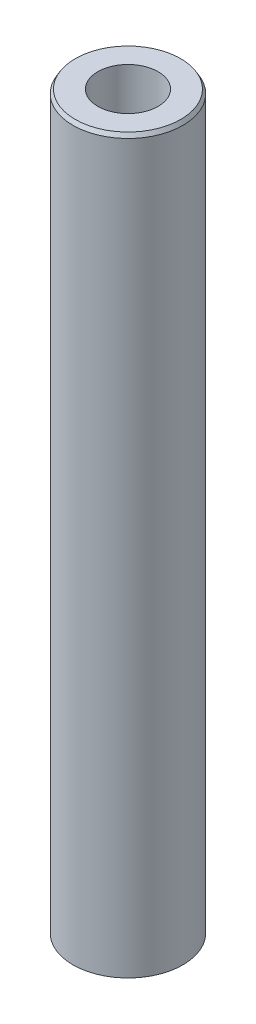
ISO-10303-21;
HEADER;
FILE_DESCRIPTION(('STEP AP214'),'2;1');
FILE_NAME('part.step','',(''),(''),'','','');
FILE_SCHEMA(('AUTOMOTIVE_DESIGN { 1 0 10303 214 1 1 1 1 }'));
ENDSEC;
DATA;
#1=APPLICATION_CONTEXT('core data for automotive mechanical design processes');
#2=APPLICATION_PROTOCOL_DEFINITION('international standard','automotive_design',2000,#1);
#3=PRODUCT_CONTEXT('',#1,'mechanical');
#4=PRODUCT('Part','Part','',(#3));
#5=PRODUCT_RELATED_PRODUCT_CATEGORY('part','',(#4));
#6=PRODUCT_DEFINITION_FORMATION('','',#4);
#7=PRODUCT_DEFINITION_CONTEXT('part definition',#1,'design');
#8=PRODUCT_DEFINITION('design','',#6,#7);
#9=PRODUCT_DEFINITION_SHAPE('','',#8);
#10=(LENGTH_UNIT() NAMED_UNIT(*) SI_UNIT(.MILLI.,.METRE.));
#11=(NAMED_UNIT(*) PLANE_ANGLE_UNIT() SI_UNIT($,.RADIAN.));
#12=(NAMED_UNIT(*) SI_UNIT($,.STERADIAN.) SOLID_ANGLE_UNIT());
#13=UNCERTAINTY_MEASURE_WITH_UNIT(LENGTH_MEASURE(1.E-05),#10,'distance_accuracy_value','');
#14=(GEOMETRIC_REPRESENTATION_CONTEXT(3) GLOBAL_UNCERTAINTY_ASSIGNED_CONTEXT((#13)) GLOBAL_UNIT_ASSIGNED_CONTEXT((#10,
#11,#12)) REPRESENTATION_CONTEXT('',''));
#15=CARTESIAN_POINT('',(0.,0.,0.));
#16=DIRECTION('',(0.,0.,1.));
#17=DIRECTION('',(1.,0.,0.));
#18=AXIS2_PLACEMENT_3D('',#15,#16,#17);
#19=CARTESIAN_POINT('',(0.,600.,0.));
#20=DIRECTION('',(0.,-1.,0.));
#21=DIRECTION('',(0.,0.,-1.));
#22=AXIS2_PLACEMENT_3D('',#19,#20,#21);
#23=CYLINDRICAL_SURFACE('',#22,45.);
#24=CARTESIAN_POINT('',(0.,596.754575426122,0.));
#25=DIRECTION('',(0.,1.,0.));
#26=DIRECTION('',(0.,0.,1.));
#27=AXIS2_PLACEMENT_3D('',#24,#25,#26);
#28=CIRCLE('',#27,45.);
#29=CARTESIAN_POINT('',(0.,596.754575426122,45.));
#30=VERTEX_POINT('',#29);
#31=EDGE_CURVE('E50',#30,#30,#28,.F.);
#32=ORIENTED_EDGE('',*,*,#31,.T.);
#33=EDGE_LOOP('',(#32));
#34=FACE_BOUND('',#33,.T.);
#35=CARTESIAN_POINT('',(0.,1.87374675136287,0.));
#36=DIRECTION('',(0.,1.,0.));
#37=DIRECTION('',(0.,0.,1.));
#38=AXIS2_PLACEMENT_3D('',#35,#36,#37);
#39=CIRCLE('',#38,45.);
#40=CARTESIAN_POINT('',(0.,1.87374675136287,45.));
#41=VERTEX_POINT('',#40);
#42=EDGE_CURVE('E51',#41,#41,#39,.T.);
#43=ORIENTED_EDGE('',*,*,#42,.T.);
#44=EDGE_LOOP('',(#43));
#45=FACE_BOUND('',#44,.T.);
#46=ADVANCED_FACE('F39',(#34,#45),#23,.T.);
#47=CARTESIAN_POINT('',(0.,600.,0.));
#48=DIRECTION('',(0.,1.,0.));
#49=DIRECTION('',(0.,0.,1.));
#50=AXIS2_PLACEMENT_3D('',#47,#48,#49);
#51=PLANE('',#50);
#52=CARTESIAN_POINT('',(0.,600.,0.));
#53=DIRECTION('',(0.,1.,0.));
#54=DIRECTION('',(0.,0.,1.));
#55=AXIS2_PLACEMENT_3D('',#52,#53,#54);
#56=CIRCLE('',#55,43.1262532486369);
#57=CARTESIAN_POINT('',(0.,600.,43.1262532486369));
#58=VERTEX_POINT('',#57);
#59=EDGE_CURVE('E54',#58,#58,#56,.T.);
#60=ORIENTED_EDGE('',*,*,#59,.T.);
#61=EDGE_LOOP('',(#60));
#62=FACE_BOUND('',#61,.T.);
#63=CARTESIAN_POINT('',(0.,600.,0.));
#64=DIRECTION('',(0.,1.,0.));
#65=DIRECTION('',(0.,0.,1.));
#66=AXIS2_PLACEMENT_3D('',#63,#64,#65);
#67=CIRCLE('',#66,24.6503774627931);
#68=CARTESIAN_POINT('',(0.,600.,24.6503774627931));
#69=VERTEX_POINT('',#68);
#70=EDGE_CURVE('E58',#69,#69,#67,.T.);
#71=ORIENTED_EDGE('',*,*,#70,.F.);
#72=EDGE_LOOP('',(#71));
#73=FACE_BOUND('',#72,.T.);
#74=ADVANCED_FACE('F69',(#62,#73),#51,.T.);
#75=CARTESIAN_POINT('',(0.,0.,0.));
#76=DIRECTION('',(0.,1.,0.));
#77=DIRECTION('',(0.,0.,1.));
#78=AXIS2_PLACEMENT_3D('',#75,#76,#77);
#79=PLANE('',#78);
#80=CARTESIAN_POINT('',(0.,0.,0.));
#81=DIRECTION('',(0.,1.,0.));
#82=DIRECTION('',(0.,0.,1.));
#83=AXIS2_PLACEMENT_3D('',#80,#81,#82);
#84=CIRCLE('',#83,41.7545754261223);
#85=CARTESIAN_POINT('',(0.,0.,41.7545754261223));
#86=VERTEX_POINT('',#85);
#87=EDGE_CURVE('E10',#86,#86,#84,.F.);
#88=ORIENTED_EDGE('',*,*,#87,.T.);
#89=EDGE_LOOP('',(#88));
#90=FACE_BOUND('',#89,.T.);
#91=CARTESIAN_POINT('',(0.,0.,0.));
#92=DIRECTION('',(0.,1.,0.));
#93=DIRECTION('',(0.,0.,1.));
#94=AXIS2_PLACEMENT_3D('',#91,#92,#93);
#95=CIRCLE('',#94,24.6503774627931);
#96=CARTESIAN_POINT('',(0.,0.,24.6503774627931));
#97=VERTEX_POINT('',#96);
#98=EDGE_CURVE('E63',#97,#97,#95,.T.);
#99=ORIENTED_EDGE('',*,*,#98,.T.);
#100=EDGE_LOOP('',(#99));
#101=FACE_BOUND('',#100,.T.);
#102=ADVANCED_FACE('F75',(#90,#101),#79,.F.);
#103=CARTESIAN_POINT('',(0.,600.,0.));
#104=DIRECTION('',(0.,-1.,0.));
#105=DIRECTION('',(0.,0.,-1.));
#106=AXIS2_PLACEMENT_3D('',#103,#104,#105);
#107=CYLINDRICAL_SURFACE('',#106,24.6503774627931);
#108=ORIENTED_EDGE('',*,*,#70,.T.);
#109=EDGE_LOOP('',(#108));
#110=FACE_BOUND('',#109,.T.);
#111=ORIENTED_EDGE('',*,*,#98,.F.);
#112=EDGE_LOOP('',(#111));
#113=FACE_BOUND('',#112,.T.);
#114=ADVANCED_FACE('F70',(#110,#113),#107,.F.);
#115=CARTESIAN_POINT('',(0.,600.,0.));
#116=DIRECTION('',(0.,-1.,0.));
#117=DIRECTION('',(0.,0.,-1.));
#118=AXIS2_PLACEMENT_3D('',#115,#116,#117);
#119=CONICAL_SURFACE('',#118,43.1262532486369,0.523598775598292);
#120=ORIENTED_EDGE('',*,*,#31,.F.);
#121=EDGE_LOOP('',(#120));
#122=FACE_BOUND('',#121,.T.);
#123=ORIENTED_EDGE('',*,*,#59,.F.);
#124=EDGE_LOOP('',(#123));
#125=FACE_BOUND('',#124,.T.);
#126=ADVANCED_FACE('F81',(#122,#125),#119,.T.);
#127=CARTESIAN_POINT('',(0.,1.87374675136287,0.));
#128=DIRECTION('',(0.,1.,0.));
#129=DIRECTION('',(0.,0.,1.));
#130=AXIS2_PLACEMENT_3D('',#127,#128,#129);
#131=CONICAL_SURFACE('',#130,45.,1.04719755119661);
#132=ORIENTED_EDGE('',*,*,#87,.F.);
#133=EDGE_LOOP('',(#132));
#134=FACE_BOUND('',#133,.T.);
#135=ORIENTED_EDGE('',*,*,#42,.F.);
#136=EDGE_LOOP('',(#135));
#137=FACE_BOUND('',#136,.T.);
#138=ADVANCED_FACE('F45',(#134,#137),#131,.T.);
#139=CLOSED_SHELL('',(#46,#74,#102,#114,#126,#138));
#140=MANIFOLD_SOLID_BREP('B2',#139);
#141=ADVANCED_BREP_SHAPE_REPRESENTATION('',(#18,#140),#14);
#142=SHAPE_DEFINITION_REPRESENTATION(#9,#141);
ENDSEC;
END-ISO-10303-21;
